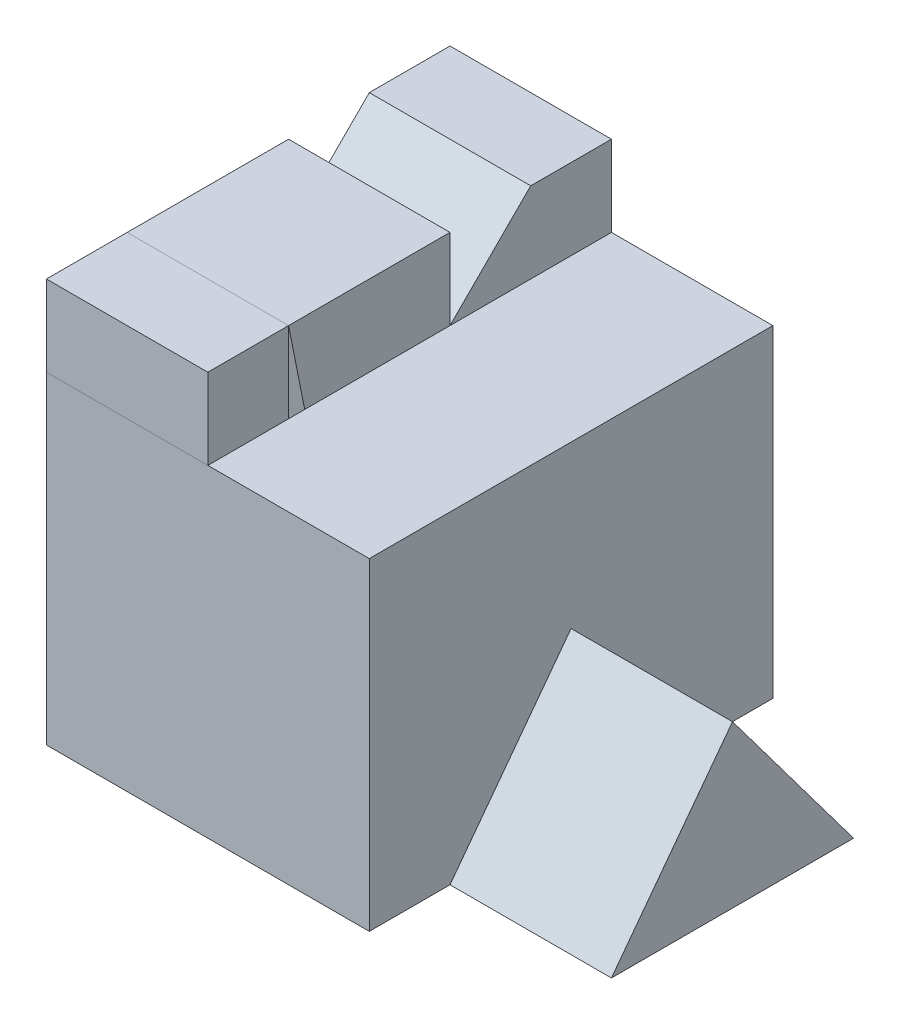
ISO-10303-21;
HEADER;
FILE_DESCRIPTION(('STEP AP214'),'2;1');
FILE_NAME('part.step','',(''),(''),'','','');
FILE_SCHEMA(('AUTOMOTIVE_DESIGN { 1 0 10303 214 1 1 1 1 }'));
ENDSEC;
DATA;
#1=APPLICATION_CONTEXT('core data for automotive mechanical design processes');
#2=APPLICATION_PROTOCOL_DEFINITION('international standard','automotive_design',2000,#1);
#3=PRODUCT_CONTEXT('',#1,'mechanical');
#4=PRODUCT('Part','Part','',(#3));
#5=PRODUCT_RELATED_PRODUCT_CATEGORY('part','',(#4));
#6=PRODUCT_DEFINITION_FORMATION('','',#4);
#7=PRODUCT_DEFINITION_CONTEXT('part definition',#1,'design');
#8=PRODUCT_DEFINITION('design','',#6,#7);
#9=PRODUCT_DEFINITION_SHAPE('','',#8);
#10=(LENGTH_UNIT() NAMED_UNIT(*) SI_UNIT(.MILLI.,.METRE.));
#11=(NAMED_UNIT(*) PLANE_ANGLE_UNIT() SI_UNIT($,.RADIAN.));
#12=(NAMED_UNIT(*) SI_UNIT($,.STERADIAN.) SOLID_ANGLE_UNIT());
#13=UNCERTAINTY_MEASURE_WITH_UNIT(LENGTH_MEASURE(1.E-05),#10,'distance_accuracy_value','');
#14=(GEOMETRIC_REPRESENTATION_CONTEXT(3) GLOBAL_UNCERTAINTY_ASSIGNED_CONTEXT((#13)) GLOBAL_UNIT_ASSIGNED_CONTEXT((#10,
#11,#12)) REPRESENTATION_CONTEXT('',''));
#15=CARTESIAN_POINT('',(0.,0.,0.));
#16=DIRECTION('',(0.,0.,1.));
#17=DIRECTION('',(1.,0.,0.));
#18=AXIS2_PLACEMENT_3D('',#15,#16,#17);
#19=CARTESIAN_POINT('',(-4.,5.,2.5));
#20=DIRECTION('',(1.,0.,0.));
#21=DIRECTION('',(0.,0.,-1.));
#22=AXIS2_PLACEMENT_3D('',#19,#20,#21);
#23=PLANE('',#22);
#24=DIRECTION('',(0.,0.,1.));
#25=VECTOR('',#24,1.);
#26=CARTESIAN_POINT('',(-4.,4.,2.5));
#27=LINE('',#26,#25);
#28=CARTESIAN_POINT('',(-4.,4.,1.5));
#29=VERTEX_POINT('',#28);
#30=CARTESIAN_POINT('',(-4.,4.,2.5));
#31=VERTEX_POINT('',#30);
#32=EDGE_CURVE('E141',#29,#31,#27,.T.);
#33=ORIENTED_EDGE('',*,*,#32,.T.);
#34=DIRECTION('',(0.,-1.,0.));
#35=VECTOR('',#34,1.);
#36=CARTESIAN_POINT('',(-4.,5.,2.5));
#37=LINE('',#36,#35);
#38=CARTESIAN_POINT('',(-4.,5.,2.5));
#39=VERTEX_POINT('',#38);
#40=EDGE_CURVE('E13',#39,#31,#37,.T.);
#41=ORIENTED_EDGE('',*,*,#40,.F.);
#42=DIRECTION('',(0.,0.,1.));
#43=VECTOR('',#42,1.);
#44=CARTESIAN_POINT('',(-4.,5.,2.5));
#45=LINE('',#44,#43);
#46=CARTESIAN_POINT('',(-4.,5.,1.5));
#47=VERTEX_POINT('',#46);
#48=EDGE_CURVE('E129',#47,#39,#45,.T.);
#49=ORIENTED_EDGE('',*,*,#48,.F.);
#50=DIRECTION('',(0.,-1.,0.));
#51=VECTOR('',#50,1.);
#52=CARTESIAN_POINT('',(-4.,5.,1.5));
#53=LINE('',#52,#51);
#54=EDGE_CURVE('E137',#47,#29,#53,.T.);
#55=ORIENTED_EDGE('',*,*,#54,.T.);
#56=EDGE_LOOP('',(#33,#41,#49,#55));
#57=FACE_BOUND('',#56,.T.);
#58=ADVANCED_FACE('F78',(#57),#23,.F.);
#59=CARTESIAN_POINT('',(-4.,5.,2.5));
#60=DIRECTION('',(0.,0.,-1.));
#61=DIRECTION('',(0.,1.,0.));
#62=AXIS2_PLACEMENT_3D('',#59,#60,#61);
#63=PLANE('',#62);
#64=DIRECTION('',(1.,0.,0.));
#65=VECTOR('',#64,1.);
#66=CARTESIAN_POINT('',(-4.,4.,2.5));
#67=LINE('',#66,#65);
#68=CARTESIAN_POINT('',(-2.,4.,2.5));
#69=VERTEX_POINT('',#68);
#70=EDGE_CURVE('E133',#31,#69,#67,.T.);
#71=ORIENTED_EDGE('',*,*,#70,.T.);
#72=DIRECTION('',(0.,-1.,0.));
#73=VECTOR('',#72,1.);
#74=CARTESIAN_POINT('',(-2.,5.,2.5));
#75=LINE('',#74,#73);
#76=CARTESIAN_POINT('',(-2.,5.,2.5));
#77=VERTEX_POINT('',#76);
#78=EDGE_CURVE('E86',#77,#69,#75,.T.);
#79=ORIENTED_EDGE('',*,*,#78,.F.);
#80=DIRECTION('',(1.,0.,0.));
#81=VECTOR('',#80,1.);
#82=CARTESIAN_POINT('',(-4.,5.,2.5));
#83=LINE('',#82,#81);
#84=EDGE_CURVE('E124',#39,#77,#83,.T.);
#85=ORIENTED_EDGE('',*,*,#84,.F.);
#86=ORIENTED_EDGE('',*,*,#40,.T.);
#87=EDGE_LOOP('',(#71,#79,#85,#86));
#88=FACE_BOUND('',#87,.T.);
#89=ADVANCED_FACE('F132',(#88),#63,.F.);
#90=CARTESIAN_POINT('',(-2.,5.,2.5));
#91=DIRECTION('',(-1.,0.,0.));
#92=DIRECTION('',(0.,0.,1.));
#93=AXIS2_PLACEMENT_3D('',#90,#91,#92);
#94=PLANE('',#93);
#95=DIRECTION('',(0.,0.,-1.));
#96=VECTOR('',#95,1.);
#97=CARTESIAN_POINT('',(-2.,4.,2.5));
#98=LINE('',#97,#96);
#99=CARTESIAN_POINT('',(-2.,4.,1.5));
#100=VERTEX_POINT('',#99);
#101=EDGE_CURVE('E111',#69,#100,#98,.T.);
#102=ORIENTED_EDGE('',*,*,#101,.T.);
#103=DIRECTION('',(0.,-1.,0.));
#104=VECTOR('',#103,1.);
#105=CARTESIAN_POINT('',(-2.,5.,1.5));
#106=LINE('',#105,#104);
#107=CARTESIAN_POINT('',(-2.,5.,1.5));
#108=VERTEX_POINT('',#107);
#109=EDGE_CURVE('E134',#108,#100,#106,.T.);
#110=ORIENTED_EDGE('',*,*,#109,.F.);
#111=DIRECTION('',(0.,0.,-1.));
#112=VECTOR('',#111,1.);
#113=CARTESIAN_POINT('',(-2.,5.,2.5));
#114=LINE('',#113,#112);
#115=EDGE_CURVE('E127',#77,#108,#114,.T.);
#116=ORIENTED_EDGE('',*,*,#115,.F.);
#117=ORIENTED_EDGE('',*,*,#78,.T.);
#118=EDGE_LOOP('',(#102,#110,#116,#117));
#119=FACE_BOUND('',#118,.T.);
#120=ADVANCED_FACE('F135',(#119),#94,.F.);
#121=CARTESIAN_POINT('',(-4.,5.,1.5));
#122=DIRECTION('',(0.,0.,1.));
#123=DIRECTION('',(0.,-1.,0.));
#124=AXIS2_PLACEMENT_3D('',#121,#122,#123);
#125=PLANE('',#124);
#126=DIRECTION('',(-1.,0.,0.));
#127=VECTOR('',#126,1.);
#128=CARTESIAN_POINT('',(-4.,4.,1.5));
#129=LINE('',#128,#127);
#130=EDGE_CURVE('E117',#100,#29,#129,.T.);
#131=ORIENTED_EDGE('',*,*,#130,.T.);
#132=ORIENTED_EDGE('',*,*,#54,.F.);
#133=DIRECTION('',(-1.,0.,0.));
#134=VECTOR('',#133,1.);
#135=CARTESIAN_POINT('',(-4.,5.,1.5));
#136=LINE('',#135,#134);
#137=EDGE_CURVE('E94',#108,#47,#136,.T.);
#138=ORIENTED_EDGE('',*,*,#137,.F.);
#139=ORIENTED_EDGE('',*,*,#109,.T.);
#140=EDGE_LOOP('',(#131,#132,#138,#139));
#141=FACE_BOUND('',#140,.T.);
#142=ADVANCED_FACE('F148',(#141),#125,.F.);
#143=CARTESIAN_POINT('',(0.,5.,0.));
#144=DIRECTION('',(0.,-1.,0.));
#145=DIRECTION('',(0.,0.,-1.));
#146=AXIS2_PLACEMENT_3D('',#143,#144,#145);
#147=PLANE('',#146);
#148=ORIENTED_EDGE('',*,*,#48,.T.);
#149=ORIENTED_EDGE('',*,*,#84,.T.);
#150=ORIENTED_EDGE('',*,*,#115,.T.);
#151=ORIENTED_EDGE('',*,*,#137,.T.);
#152=EDGE_LOOP('',(#148,#149,#150,#151));
#153=FACE_BOUND('',#152,.T.);
#154=ADVANCED_FACE('F125',(#153),#147,.F.);
#155=CARTESIAN_POINT('',(0.,4.,0.));
#156=DIRECTION('',(0.,-1.,0.));
#157=DIRECTION('',(0.,0.,-1.));
#158=AXIS2_PLACEMENT_3D('',#155,#156,#157);
#159=PLANE('',#158);
#160=ORIENTED_EDGE('',*,*,#32,.F.);
#161=ORIENTED_EDGE('',*,*,#130,.F.);
#162=ORIENTED_EDGE('',*,*,#101,.F.);
#163=ORIENTED_EDGE('',*,*,#70,.F.);
#164=EDGE_LOOP('',(#160,#161,#162,#163));
#165=FACE_BOUND('',#164,.T.);
#166=ADVANCED_FACE('F151',(#165),#159,.T.);
#167=CLOSED_SHELL('',(#58,#89,#120,#142,#154,#166));
#168=MANIFOLD_SOLID_BREP('B2',#167);
#169=CARTESIAN_POINT('',(2.,0.,-1.5));
#170=DIRECTION('',(0.,1.,0.));
#171=DIRECTION('',(0.,0.,1.));
#172=AXIS2_PLACEMENT_3D('',#169,#170,#171);
#173=PLANE('',#172);
#174=DIRECTION('',(-1.,0.,0.));
#175=VECTOR('',#174,1.);
#176=CARTESIAN_POINT('',(2.,0.,1.5));
#177=LINE('',#176,#175);
#178=CARTESIAN_POINT('',(2.,0.,1.5));
#179=VERTEX_POINT('',#178);
#180=CARTESIAN_POINT('',(0.,0.,1.5));
#181=VERTEX_POINT('',#180);
#182=EDGE_CURVE('E696',#179,#181,#177,.T.);
#183=ORIENTED_EDGE('',*,*,#182,.T.);
#184=DIRECTION('',(0.,0.,1.));
#185=VECTOR('',#184,1.);
#186=CARTESIAN_POINT('',(0.,0.,2.5));
#187=LINE('',#186,#185);
#188=CARTESIAN_POINT('',(0.,0.,2.5));
#189=VERTEX_POINT('',#188);
#190=EDGE_CURVE('E399',#181,#189,#187,.T.);
#191=ORIENTED_EDGE('',*,*,#190,.T.);
#192=DIRECTION('',(1.,0.,0.));
#193=VECTOR('',#192,1.);
#194=CARTESIAN_POINT('',(-2.,0.,2.5));
#195=LINE('',#194,#193);
#196=CARTESIAN_POINT('',(-4.,0.,2.5));
#197=VERTEX_POINT('',#196);
#198=EDGE_CURVE('E330',#197,#189,#195,.T.);
#199=ORIENTED_EDGE('',*,*,#198,.F.);
#200=DIRECTION('',(0.,0.,1.));
#201=VECTOR('',#200,1.);
#202=CARTESIAN_POINT('',(-4.,0.,0.));
#203=LINE('',#202,#201);
#204=CARTESIAN_POINT('',(-4.,0.,1.5));
#205=VERTEX_POINT('',#204);
#206=EDGE_CURVE('E327',#205,#197,#203,.T.);
#207=ORIENTED_EDGE('',*,*,#206,.F.);
#208=DIRECTION('',(1.,0.,0.));
#209=VECTOR('',#208,1.);
#210=CARTESIAN_POINT('',(-4.,0.,1.5));
#211=LINE('',#210,#209);
#212=CARTESIAN_POINT('',(-2.,0.,1.5));
#213=VERTEX_POINT('',#212);
#214=EDGE_CURVE('E315',#205,#213,#211,.T.);
#215=ORIENTED_EDGE('',*,*,#214,.T.);
#216=DIRECTION('',(0.,0.,1.));
#217=VECTOR('',#216,1.);
#218=CARTESIAN_POINT('',(-2.,0.,2.5));
#219=LINE('',#218,#217);
#220=CARTESIAN_POINT('',(-2.,0.,0.500000000000001));
#221=VERTEX_POINT('',#220);
#222=EDGE_CURVE('E217',#221,#213,#219,.T.);
#223=ORIENTED_EDGE('',*,*,#222,.F.);
#224=DIRECTION('',(1.,0.,0.));
#225=VECTOR('',#224,1.);
#226=CARTESIAN_POINT('',(-4.,0.,0.5));
#227=LINE('',#226,#225);
#228=CARTESIAN_POINT('',(-4.,0.,0.5));
#229=VERTEX_POINT('',#228);
#230=EDGE_CURVE('E225',#229,#221,#227,.T.);
#231=ORIENTED_EDGE('',*,*,#230,.F.);
#232=DIRECTION('',(0.,0.,1.));
#233=VECTOR('',#232,1.);
#234=CARTESIAN_POINT('',(-4.,0.,0.));
#235=LINE('',#234,#233);
#236=CARTESIAN_POINT('',(-4.,0.,-2.5));
#237=VERTEX_POINT('',#236);
#238=EDGE_CURVE('E364',#237,#229,#235,.T.);
#239=ORIENTED_EDGE('',*,*,#238,.F.);
#240=DIRECTION('',(1.,0.,0.));
#241=VECTOR('',#240,1.);
#242=CARTESIAN_POINT('',(-2.,0.,-2.5));
#243=LINE('',#242,#241);
#244=CARTESIAN_POINT('',(0.,0.,-2.5));
#245=VERTEX_POINT('',#244);
#246=EDGE_CURVE('E412',#237,#245,#243,.T.);
#247=ORIENTED_EDGE('',*,*,#246,.T.);
#248=CARTESIAN_POINT('',(0.,0.,-1.5));
#249=VERTEX_POINT('',#248);
#250=EDGE_CURVE('E382',#245,#249,#187,.T.);
#251=ORIENTED_EDGE('',*,*,#250,.T.);
#252=DIRECTION('',(-1.,0.,0.));
#253=VECTOR('',#252,1.);
#254=CARTESIAN_POINT('',(2.,0.,-1.5));
#255=LINE('',#254,#253);
#256=CARTESIAN_POINT('',(2.,0.,-1.5));
#257=VERTEX_POINT('',#256);
#258=EDGE_CURVE('E210',#257,#249,#255,.T.);
#259=ORIENTED_EDGE('',*,*,#258,.F.);
#260=DIRECTION('',(0.,0.,-1.));
#261=VECTOR('',#260,1.);
#262=CARTESIAN_POINT('',(2.,0.,-1.5));
#263=LINE('',#262,#261);
#264=EDGE_CURVE('E684',#179,#257,#263,.T.);
#265=ORIENTED_EDGE('',*,*,#264,.F.);
#266=EDGE_LOOP('',(#183,#191,#199,#207,#215,#223,#231,#239,#247,#251,#259,#265));
#267=FACE_BOUND('',#266,.T.);
#268=ADVANCED_FACE('F202',(#267),#173,.F.);
#269=CARTESIAN_POINT('',(2.,2.,0.));
#270=DIRECTION('',(0.,-0.6,0.8));
#271=DIRECTION('',(0.,-0.8,-0.6));
#272=AXIS2_PLACEMENT_3D('',#269,#270,#271);
#273=PLANE('',#272);
#274=DIRECTION('',(0.,0.8,0.6));
#275=VECTOR('',#274,1.);
#276=CARTESIAN_POINT('',(0.,2.,0.));
#277=LINE('',#276,#275);
#278=CARTESIAN_POINT('',(0.,2.,0.));
#279=VERTEX_POINT('',#278);
#280=EDGE_CURVE('E411',#249,#279,#277,.T.);
#281=ORIENTED_EDGE('',*,*,#280,.T.);
#282=DIRECTION('',(-1.,0.,0.));
#283=VECTOR('',#282,1.);
#284=CARTESIAN_POINT('',(2.,2.,0.));
#285=LINE('',#284,#283);
#286=CARTESIAN_POINT('',(2.,2.,0.));
#287=VERTEX_POINT('',#286);
#288=EDGE_CURVE('E693',#287,#279,#285,.T.);
#289=ORIENTED_EDGE('',*,*,#288,.F.);
#290=DIRECTION('',(0.,0.8,0.6));
#291=VECTOR('',#290,1.);
#292=CARTESIAN_POINT('',(2.,2.,0.));
#293=LINE('',#292,#291);
#294=EDGE_CURVE('E686',#257,#287,#293,.T.);
#295=ORIENTED_EDGE('',*,*,#294,.F.);
#296=ORIENTED_EDGE('',*,*,#258,.T.);
#297=EDGE_LOOP('',(#281,#289,#295,#296));
#298=FACE_BOUND('',#297,.T.);
#299=ADVANCED_FACE('F446',(#298),#273,.F.);
#300=CARTESIAN_POINT('',(2.,0.,1.5));
#301=DIRECTION('',(0.,-0.6,-0.8));
#302=DIRECTION('',(0.,0.8,-0.6));
#303=AXIS2_PLACEMENT_3D('',#300,#301,#302);
#304=PLANE('',#303);
#305=DIRECTION('',(0.,-0.8,0.6));
#306=VECTOR('',#305,1.);
#307=CARTESIAN_POINT('',(0.,0.,1.5));
#308=LINE('',#307,#306);
#309=EDGE_CURVE('E691',#279,#181,#308,.T.);
#310=ORIENTED_EDGE('',*,*,#309,.T.);
#311=ORIENTED_EDGE('',*,*,#182,.F.);
#312=DIRECTION('',(0.,-0.8,0.6));
#313=VECTOR('',#312,1.);
#314=CARTESIAN_POINT('',(2.,0.,1.5));
#315=LINE('',#314,#313);
#316=EDGE_CURVE('E689',#287,#179,#315,.T.);
#317=ORIENTED_EDGE('',*,*,#316,.F.);
#318=ORIENTED_EDGE('',*,*,#288,.T.);
#319=EDGE_LOOP('',(#310,#311,#317,#318));
#320=FACE_BOUND('',#319,.T.);
#321=ADVANCED_FACE('F450',(#320),#304,.F.);
#322=CARTESIAN_POINT('',(2.,0.,0.));
#323=DIRECTION('',(-1.,0.,0.));
#324=DIRECTION('',(0.,0.,1.));
#325=AXIS2_PLACEMENT_3D('',#322,#323,#324);
#326=PLANE('',#325);
#327=ORIENTED_EDGE('',*,*,#264,.T.);
#328=ORIENTED_EDGE('',*,*,#294,.T.);
#329=ORIENTED_EDGE('',*,*,#316,.T.);
#330=EDGE_LOOP('',(#327,#328,#329));
#331=FACE_BOUND('',#330,.T.);
#332=ADVANCED_FACE('F455',(#331),#326,.F.);
#333=CARTESIAN_POINT('',(0.,0.,0.));
#334=DIRECTION('',(1.,0.,0.));
#335=DIRECTION('',(0.,0.,-1.));
#336=AXIS2_PLACEMENT_3D('',#333,#334,#335);
#337=PLANE('',#336);
#338=ORIENTED_EDGE('',*,*,#309,.F.);
#339=ORIENTED_EDGE('',*,*,#280,.F.);
#340=ORIENTED_EDGE('',*,*,#250,.F.);
#341=DIRECTION('',(0.,-1.,0.));
#342=VECTOR('',#341,1.);
#343=CARTESIAN_POINT('',(0.,0.,-2.5));
#344=LINE('',#343,#342);
#345=CARTESIAN_POINT('',(0.,4.,-2.5));
#346=VERTEX_POINT('',#345);
#347=EDGE_CURVE('E397',#346,#245,#344,.T.);
#348=ORIENTED_EDGE('',*,*,#347,.F.);
#349=DIRECTION('',(0.,0.,-1.));
#350=VECTOR('',#349,1.);
#351=CARTESIAN_POINT('',(0.,4.,-2.5));
#352=LINE('',#351,#350);
#353=CARTESIAN_POINT('',(0.,4.,2.5));
#354=VERTEX_POINT('',#353);
#355=EDGE_CURVE('E394',#354,#346,#352,.T.);
#356=ORIENTED_EDGE('',*,*,#355,.F.);
#357=DIRECTION('',(0.,1.,0.));
#358=VECTOR('',#357,1.);
#359=CARTESIAN_POINT('',(0.,4.,2.5));
#360=LINE('',#359,#358);
#361=EDGE_CURVE('E391',#189,#354,#360,.T.);
#362=ORIENTED_EDGE('',*,*,#361,.F.);
#363=ORIENTED_EDGE('',*,*,#190,.F.);
#364=EDGE_LOOP('',(#338,#339,#340,#348,#356,#362,#363));
#365=FACE_BOUND('',#364,.T.);
#366=ADVANCED_FACE('F421',(#365),#337,.T.);
#367=CARTESIAN_POINT('',(-2.,4.,2.5));
#368=DIRECTION('',(0.,0.,-1.));
#369=DIRECTION('',(0.,1.,0.));
#370=AXIS2_PLACEMENT_3D('',#367,#368,#369);
#371=PLANE('',#370);
#372=ORIENTED_EDGE('',*,*,#361,.T.);
#373=DIRECTION('',(1.,0.,0.));
#374=VECTOR('',#373,1.);
#375=CARTESIAN_POINT('',(-2.,4.,2.5));
#376=LINE('',#375,#374);
#377=CARTESIAN_POINT('',(-4.,4.,2.5));
#378=VERTEX_POINT('',#377);
#379=EDGE_CURVE('E409',#378,#354,#376,.T.);
#380=ORIENTED_EDGE('',*,*,#379,.F.);
#381=DIRECTION('',(0.,1.,0.));
#382=VECTOR('',#381,1.);
#383=CARTESIAN_POINT('',(-4.,0.,2.5));
#384=LINE('',#383,#382);
#385=EDGE_CURVE('E334',#197,#378,#384,.T.);
#386=ORIENTED_EDGE('',*,*,#385,.F.);
#387=ORIENTED_EDGE('',*,*,#198,.T.);
#388=EDGE_LOOP('',(#372,#380,#386,#387));
#389=FACE_BOUND('',#388,.T.);
#390=ADVANCED_FACE('F419',(#389),#371,.F.);
#391=CARTESIAN_POINT('',(-2.,4.,-2.5));
#392=DIRECTION('',(0.,-1.,0.));
#393=DIRECTION('',(0.,0.,-1.));
#394=AXIS2_PLACEMENT_3D('',#391,#392,#393);
#395=PLANE('',#394);
#396=ORIENTED_EDGE('',*,*,#355,.T.);
#397=DIRECTION('',(1.,0.,0.));
#398=VECTOR('',#397,1.);
#399=CARTESIAN_POINT('',(-2.,4.,-2.5));
#400=LINE('',#399,#398);
#401=CARTESIAN_POINT('',(-2.,4.,-2.5));
#402=VERTEX_POINT('',#401);
#403=EDGE_CURVE('E383',#402,#346,#400,.T.);
#404=ORIENTED_EDGE('',*,*,#403,.F.);
#405=DIRECTION('',(0.,0.,-1.));
#406=VECTOR('',#405,1.);
#407=CARTESIAN_POINT('',(-2.,4.,-2.5));
#408=LINE('',#407,#406);
#409=CARTESIAN_POINT('',(-2.,4.,-0.5));
#410=VERTEX_POINT('',#409);
#411=EDGE_CURVE('E379',#410,#402,#408,.T.);
#412=ORIENTED_EDGE('',*,*,#411,.F.);
#413=CARTESIAN_POINT('',(-2.,4.,1.3));
#414=VERTEX_POINT('',#413);
#415=EDGE_CURVE('E381',#414,#410,#408,.T.);
#416=ORIENTED_EDGE('',*,*,#415,.F.);
#417=CARTESIAN_POINT('',(-2.,4.,1.5));
#418=VERTEX_POINT('',#417);
#419=EDGE_CURVE('E384',#418,#414,#408,.T.);
#420=ORIENTED_EDGE('',*,*,#419,.F.);
#421=DIRECTION('',(1.,0.,0.));
#422=VECTOR('',#421,1.);
#423=CARTESIAN_POINT('',(-4.,4.,1.5));
#424=LINE('',#423,#422);
#425=CARTESIAN_POINT('',(-4.,4.,1.5));
#426=VERTEX_POINT('',#425);
#427=EDGE_CURVE('E324',#426,#418,#424,.T.);
#428=ORIENTED_EDGE('',*,*,#427,.F.);
#429=DIRECTION('',(0.,0.,-1.));
#430=VECTOR('',#429,1.);
#431=CARTESIAN_POINT('',(-4.,4.,0.));
#432=LINE('',#431,#430);
#433=EDGE_CURVE('E338',#378,#426,#432,.T.);
#434=ORIENTED_EDGE('',*,*,#433,.F.);
#435=ORIENTED_EDGE('',*,*,#379,.T.);
#436=EDGE_LOOP('',(#396,#404,#412,#416,#420,#428,#434,#435));
#437=FACE_BOUND('',#436,.T.);
#438=ADVANCED_FACE('F426',(#437),#395,.F.);
#439=CARTESIAN_POINT('',(-2.,0.,-2.5));
#440=DIRECTION('',(0.,0.,1.));
#441=DIRECTION('',(0.,-1.,0.));
#442=AXIS2_PLACEMENT_3D('',#439,#440,#441);
#443=PLANE('',#442);
#444=ORIENTED_EDGE('',*,*,#347,.T.);
#445=ORIENTED_EDGE('',*,*,#246,.F.);
#446=DIRECTION('',(0.,-1.,0.));
#447=VECTOR('',#446,1.);
#448=CARTESIAN_POINT('',(-4.,0.,-2.5));
#449=LINE('',#448,#447);
#450=CARTESIAN_POINT('',(-4.,5.,-2.5));
#451=VERTEX_POINT('',#450);
#452=EDGE_CURVE('E361',#451,#237,#449,.T.);
#453=ORIENTED_EDGE('',*,*,#452,.F.);
#454=DIRECTION('',(1.,0.,0.));
#455=VECTOR('',#454,1.);
#456=CARTESIAN_POINT('',(-4.,5.,-2.5));
#457=LINE('',#456,#455);
#458=CARTESIAN_POINT('',(-2.,5.,-2.5));
#459=VERTEX_POINT('',#458);
#460=EDGE_CURVE('E376',#451,#459,#457,.T.);
#461=ORIENTED_EDGE('',*,*,#460,.T.);
#462=DIRECTION('',(0.,-1.,0.));
#463=VECTOR('',#462,1.);
#464=CARTESIAN_POINT('',(-2.,0.,-2.5));
#465=LINE('',#464,#463);
#466=EDGE_CURVE('E349',#459,#402,#465,.T.);
#467=ORIENTED_EDGE('',*,*,#466,.T.);
#468=ORIENTED_EDGE('',*,*,#403,.T.);
#469=EDGE_LOOP('',(#444,#445,#453,#461,#467,#468));
#470=FACE_BOUND('',#469,.T.);
#471=ADVANCED_FACE('F432',(#470),#443,.F.);
#472=CARTESIAN_POINT('',(-2.,0.,0.));
#473=DIRECTION('',(1.,0.,0.));
#474=DIRECTION('',(0.,0.,-1.));
#475=AXIS2_PLACEMENT_3D('',#472,#473,#474);
#476=PLANE('',#475);
#477=ORIENTED_EDGE('',*,*,#222,.T.);
#478=DIRECTION('',(0.,1.,0.));
#479=VECTOR('',#478,1.);
#480=CARTESIAN_POINT('',(-2.,0.,1.5));
#481=LINE('',#480,#479);
#482=EDGE_CURVE('E321',#213,#418,#481,.T.);
#483=ORIENTED_EDGE('',*,*,#482,.T.);
#484=ORIENTED_EDGE('',*,*,#419,.T.);
#485=DIRECTION('',(0.,-0.98058067569092,-0.196116135138184));
#486=VECTOR('',#485,1.);
#487=CARTESIAN_POINT('',(-2.,-0.0961538461538462,0.480769230769231));
#488=LINE('',#487,#486);
#489=EDGE_CURVE('E76',#414,#221,#488,.T.);
#490=ORIENTED_EDGE('',*,*,#489,.T.);
#491=EDGE_LOOP('',(#477,#483,#484,#490));
#492=FACE_BOUND('',#491,.T.);
#493=ADVANCED_FACE('F429',(#492),#476,.F.);
#494=CARTESIAN_POINT('',(-2.,0.,0.));
#495=DIRECTION('',(-1.,0.,0.));
#496=DIRECTION('',(0.,0.,1.));
#497=AXIS2_PLACEMENT_3D('',#494,#495,#496);
#498=PLANE('',#497);
#499=CARTESIAN_POINT('',(-2.,5.,1.5));
#500=VERTEX_POINT('',#499);
#501=EDGE_CURVE('E323',#500,#414,#488,.T.);
#502=ORIENTED_EDGE('',*,*,#501,.T.);
#503=ORIENTED_EDGE('',*,*,#415,.T.);
#504=DIRECTION('',(0.,1.,0.));
#505=VECTOR('',#504,1.);
#506=CARTESIAN_POINT('',(-2.,0.,-0.500000000000001));
#507=LINE('',#506,#505);
#508=CARTESIAN_POINT('',(-2.,5.,-0.500000000000001));
#509=VERTEX_POINT('',#508);
#510=EDGE_CURVE('E616',#410,#509,#507,.T.);
#511=ORIENTED_EDGE('',*,*,#510,.T.);
#512=DIRECTION('',(0.,0.,1.));
#513=VECTOR('',#512,1.);
#514=CARTESIAN_POINT('',(-2.,5.,0.));
#515=LINE('',#514,#513);
#516=EDGE_CURVE('E369',#509,#500,#515,.T.);
#517=ORIENTED_EDGE('',*,*,#516,.T.);
#518=EDGE_LOOP('',(#502,#503,#511,#517));
#519=FACE_BOUND('',#518,.T.);
#520=ADVANCED_FACE('F431',(#519),#498,.F.);
#521=DIRECTION('',(0.,-0.707106781186547,0.707106781186548));
#522=VECTOR('',#521,1.);
#523=CARTESIAN_POINT('',(-2.,1.75,1.75));
#524=LINE('',#523,#522);
#525=CARTESIAN_POINT('',(-2.,5.,-1.5));
#526=VERTEX_POINT('',#525);
#527=EDGE_CURVE('E614',#526,#410,#524,.T.);
#528=ORIENTED_EDGE('',*,*,#527,.T.);
#529=ORIENTED_EDGE('',*,*,#411,.T.);
#530=ORIENTED_EDGE('',*,*,#466,.F.);
#531=DIRECTION('',(0.,0.,1.));
#532=VECTOR('',#531,1.);
#533=CARTESIAN_POINT('',(-2.,5.,0.));
#534=LINE('',#533,#532);
#535=EDGE_CURVE('E611',#459,#526,#534,.T.);
#536=ORIENTED_EDGE('',*,*,#535,.T.);
#537=EDGE_LOOP('',(#528,#529,#530,#536));
#538=FACE_BOUND('',#537,.T.);
#539=ADVANCED_FACE('F438',(#538),#498,.F.);
#540=CARTESIAN_POINT('',(-4.,-0.0961538461538462,0.480769230769231));
#541=DIRECTION('',(0.,-0.196116135138184,0.98058067569092));
#542=DIRECTION('',(0.,-0.98058067569092,-0.196116135138184));
#543=AXIS2_PLACEMENT_3D('',#540,#541,#542);
#544=PLANE('',#543);
#545=ORIENTED_EDGE('',*,*,#501,.F.);
#546=DIRECTION('',(1.,0.,0.));
#547=VECTOR('',#546,1.);
#548=CARTESIAN_POINT('',(-4.,5.,1.5));
#549=LINE('',#548,#547);
#550=CARTESIAN_POINT('',(-4.,5.,1.5));
#551=VERTEX_POINT('',#550);
#552=EDGE_CURVE('E395',#551,#500,#549,.T.);
#553=ORIENTED_EDGE('',*,*,#552,.F.);
#554=DIRECTION('',(0.,-0.98058067569092,-0.196116135138184));
#555=VECTOR('',#554,1.);
#556=CARTESIAN_POINT('',(-4.,-0.0961538461538462,0.480769230769231));
#557=LINE('',#556,#555);
#558=EDGE_CURVE('E346',#551,#229,#557,.T.);
#559=ORIENTED_EDGE('',*,*,#558,.T.);
#560=ORIENTED_EDGE('',*,*,#230,.T.);
#561=ORIENTED_EDGE('',*,*,#489,.F.);
#562=EDGE_LOOP('',(#545,#553,#559,#560,#561));
#563=FACE_BOUND('',#562,.T.);
#564=ADVANCED_FACE('F509',(#563),#544,.T.);
#565=CARTESIAN_POINT('',(-4.,5.,0.));
#566=DIRECTION('',(0.,1.,0.));
#567=DIRECTION('',(0.,0.,1.));
#568=AXIS2_PLACEMENT_3D('',#565,#566,#567);
#569=PLANE('',#568);
#570=ORIENTED_EDGE('',*,*,#516,.F.);
#571=DIRECTION('',(1.,0.,0.));
#572=VECTOR('',#571,1.);
#573=CARTESIAN_POINT('',(-4.,5.,-0.500000000000001));
#574=LINE('',#573,#572);
#575=CARTESIAN_POINT('',(-4.,5.,-0.500000000000001));
#576=VERTEX_POINT('',#575);
#577=EDGE_CURVE('E598',#576,#509,#574,.T.);
#578=ORIENTED_EDGE('',*,*,#577,.F.);
#579=DIRECTION('',(0.,0.,1.));
#580=VECTOR('',#579,1.);
#581=CARTESIAN_POINT('',(-4.,5.,0.));
#582=LINE('',#581,#580);
#583=EDGE_CURVE('E348',#576,#551,#582,.T.);
#584=ORIENTED_EDGE('',*,*,#583,.T.);
#585=ORIENTED_EDGE('',*,*,#552,.T.);
#586=EDGE_LOOP('',(#570,#578,#584,#585));
#587=FACE_BOUND('',#586,.T.);
#588=ADVANCED_FACE('F519',(#587),#569,.T.);
#589=CARTESIAN_POINT('',(-4.,0.,-0.500000000000001));
#590=DIRECTION('',(0.,0.,-1.));
#591=DIRECTION('',(-1.,0.,0.));
#592=AXIS2_PLACEMENT_3D('',#589,#590,#591);
#593=PLANE('',#592);
#594=ORIENTED_EDGE('',*,*,#510,.F.);
#595=DIRECTION('',(1.,0.,0.));
#596=VECTOR('',#595,1.);
#597=CARTESIAN_POINT('',(-4.,4.,-0.5));
#598=LINE('',#597,#596);
#599=CARTESIAN_POINT('',(-4.,4.,-0.5));
#600=VERTEX_POINT('',#599);
#601=EDGE_CURVE('E602',#600,#410,#598,.T.);
#602=ORIENTED_EDGE('',*,*,#601,.F.);
#603=DIRECTION('',(0.,1.,0.));
#604=VECTOR('',#603,1.);
#605=CARTESIAN_POINT('',(-4.,0.,-0.500000000000001));
#606=LINE('',#605,#604);
#607=EDGE_CURVE('E352',#600,#576,#606,.T.);
#608=ORIENTED_EDGE('',*,*,#607,.T.);
#609=ORIENTED_EDGE('',*,*,#577,.T.);
#610=EDGE_LOOP('',(#594,#602,#608,#609));
#611=FACE_BOUND('',#610,.T.);
#612=ADVANCED_FACE('F527',(#611),#593,.T.);
#613=CARTESIAN_POINT('',(-4.,1.75,1.75));
#614=DIRECTION('',(0.,0.707106781186548,0.707106781186547));
#615=DIRECTION('',(0.,-0.707106781186547,0.707106781186548));
#616=AXIS2_PLACEMENT_3D('',#613,#614,#615);
#617=PLANE('',#616);
#618=ORIENTED_EDGE('',*,*,#527,.F.);
#619=DIRECTION('',(1.,0.,0.));
#620=VECTOR('',#619,1.);
#621=CARTESIAN_POINT('',(-4.,5.,-1.5));
#622=LINE('',#621,#620);
#623=CARTESIAN_POINT('',(-4.,5.,-1.5));
#624=VERTEX_POINT('',#623);
#625=EDGE_CURVE('E605',#624,#526,#622,.T.);
#626=ORIENTED_EDGE('',*,*,#625,.F.);
#627=DIRECTION('',(0.,-0.707106781186547,0.707106781186548));
#628=VECTOR('',#627,1.);
#629=CARTESIAN_POINT('',(-4.,1.75,1.75));
#630=LINE('',#629,#628);
#631=EDGE_CURVE('E355',#624,#600,#630,.T.);
#632=ORIENTED_EDGE('',*,*,#631,.T.);
#633=ORIENTED_EDGE('',*,*,#601,.T.);
#634=EDGE_LOOP('',(#618,#626,#632,#633));
#635=FACE_BOUND('',#634,.T.);
#636=ADVANCED_FACE('F537',(#635),#617,.T.);
#637=CARTESIAN_POINT('',(-4.,5.,0.));
#638=DIRECTION('',(0.,1.,0.));
#639=DIRECTION('',(0.,0.,1.));
#640=AXIS2_PLACEMENT_3D('',#637,#638,#639);
#641=PLANE('',#640);
#642=ORIENTED_EDGE('',*,*,#535,.F.);
#643=ORIENTED_EDGE('',*,*,#460,.F.);
#644=DIRECTION('',(0.,0.,1.));
#645=VECTOR('',#644,1.);
#646=CARTESIAN_POINT('',(-4.,5.,0.));
#647=LINE('',#646,#645);
#648=EDGE_CURVE('E358',#451,#624,#647,.T.);
#649=ORIENTED_EDGE('',*,*,#648,.T.);
#650=ORIENTED_EDGE('',*,*,#625,.T.);
#651=EDGE_LOOP('',(#642,#643,#649,#650));
#652=FACE_BOUND('',#651,.T.);
#653=ADVANCED_FACE('F547',(#652),#641,.T.);
#654=CARTESIAN_POINT('',(-4.,0.,0.));
#655=DIRECTION('',(-1.,0.,0.));
#656=DIRECTION('',(0.,0.,1.));
#657=AXIS2_PLACEMENT_3D('',#654,#655,#656);
#658=PLANE('',#657);
#659=ORIENTED_EDGE('',*,*,#558,.F.);
#660=ORIENTED_EDGE('',*,*,#583,.F.);
#661=ORIENTED_EDGE('',*,*,#607,.F.);
#662=ORIENTED_EDGE('',*,*,#631,.F.);
#663=ORIENTED_EDGE('',*,*,#648,.F.);
#664=ORIENTED_EDGE('',*,*,#452,.T.);
#665=ORIENTED_EDGE('',*,*,#238,.T.);
#666=EDGE_LOOP('',(#659,#660,#661,#662,#663,#664,#665));
#667=FACE_BOUND('',#666,.T.);
#668=ADVANCED_FACE('F557',(#667),#658,.T.);
#669=CARTESIAN_POINT('',(-4.,0.,1.5));
#670=DIRECTION('',(0.,0.,-1.));
#671=DIRECTION('',(0.,1.,0.));
#672=AXIS2_PLACEMENT_3D('',#669,#670,#671);
#673=PLANE('',#672);
#674=ORIENTED_EDGE('',*,*,#482,.F.);
#675=ORIENTED_EDGE('',*,*,#214,.F.);
#676=DIRECTION('',(0.,1.,0.));
#677=VECTOR('',#676,1.);
#678=CARTESIAN_POINT('',(-4.,0.,1.5));
#679=LINE('',#678,#677);
#680=EDGE_CURVE('E320',#205,#426,#679,.T.);
#681=ORIENTED_EDGE('',*,*,#680,.T.);
#682=ORIENTED_EDGE('',*,*,#427,.T.);
#683=EDGE_LOOP('',(#674,#675,#681,#682));
#684=FACE_BOUND('',#683,.T.);
#685=ADVANCED_FACE('F317',(#684),#673,.T.);
#686=CARTESIAN_POINT('',(-4.,0.,0.));
#687=DIRECTION('',(-1.,0.,0.));
#688=DIRECTION('',(0.,0.,1.));
#689=AXIS2_PLACEMENT_3D('',#686,#687,#688);
#690=PLANE('',#689);
#691=ORIENTED_EDGE('',*,*,#680,.F.);
#692=ORIENTED_EDGE('',*,*,#206,.T.);
#693=ORIENTED_EDGE('',*,*,#385,.T.);
#694=ORIENTED_EDGE('',*,*,#433,.T.);
#695=EDGE_LOOP('',(#691,#692,#693,#694));
#696=FACE_BOUND('',#695,.T.);
#697=ADVANCED_FACE('F336',(#696),#690,.T.);
#698=CLOSED_SHELL('',(#268,#299,#321,#332,#366,#390,#438,#471,#493,#520,#539,#564,#588,#612,
#636,#653,#668,#685,#697));
#699=MANIFOLD_SOLID_BREP('B7',#698);
#700=ADVANCED_BREP_SHAPE_REPRESENTATION('',(#18,#168,#699),#14);
#701=SHAPE_DEFINITION_REPRESENTATION(#9,#700);
ENDSEC;
END-ISO-10303-21;
